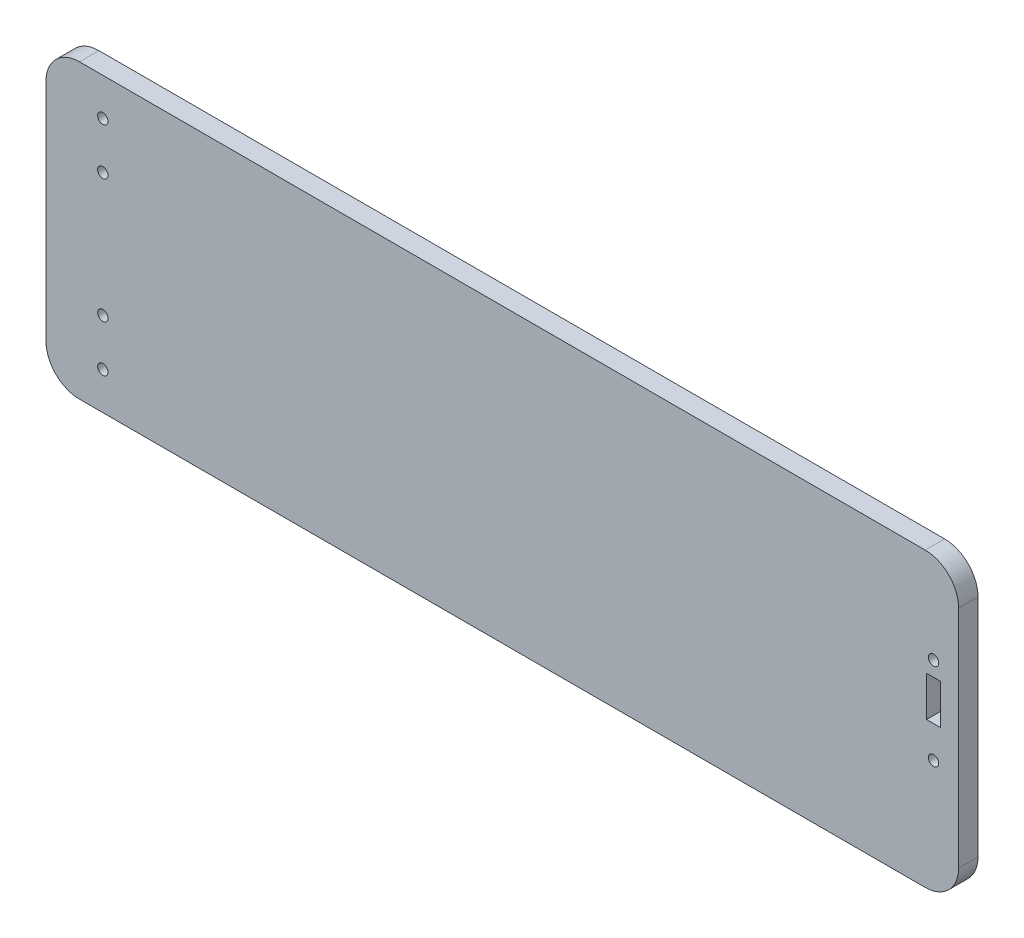
ISO-10303-21;
HEADER;
FILE_DESCRIPTION(('STEP AP214'),'2;1');
FILE_NAME('part.step','',(''),(''),'','','');
FILE_SCHEMA(('AUTOMOTIVE_DESIGN { 1 0 10303 214 1 1 1 1 }'));
ENDSEC;
DATA;
#1=APPLICATION_CONTEXT('core data for automotive mechanical design processes');
#2=APPLICATION_PROTOCOL_DEFINITION('international standard','automotive_design',2000,#1);
#3=PRODUCT_CONTEXT('',#1,'mechanical');
#4=PRODUCT('Part','Part','',(#3));
#5=PRODUCT_RELATED_PRODUCT_CATEGORY('part','',(#4));
#6=PRODUCT_DEFINITION_FORMATION('','',#4);
#7=PRODUCT_DEFINITION_CONTEXT('part definition',#1,'design');
#8=PRODUCT_DEFINITION('design','',#6,#7);
#9=PRODUCT_DEFINITION_SHAPE('','',#8);
#10=(LENGTH_UNIT() NAMED_UNIT(*) SI_UNIT(.MILLI.,.METRE.));
#11=(NAMED_UNIT(*) PLANE_ANGLE_UNIT() SI_UNIT($,.RADIAN.));
#12=(NAMED_UNIT(*) SI_UNIT($,.STERADIAN.) SOLID_ANGLE_UNIT());
#13=UNCERTAINTY_MEASURE_WITH_UNIT(LENGTH_MEASURE(1.E-05),#10,'distance_accuracy_value','');
#14=(GEOMETRIC_REPRESENTATION_CONTEXT(3) GLOBAL_UNCERTAINTY_ASSIGNED_CONTEXT((#13)) GLOBAL_UNIT_ASSIGNED_CONTEXT((#10,
#11,#12)) REPRESENTATION_CONTEXT('',''));
#15=CARTESIAN_POINT('',(0.,0.,0.));
#16=DIRECTION('',(0.,0.,1.));
#17=DIRECTION('',(1.,0.,0.));
#18=AXIS2_PLACEMENT_3D('',#15,#16,#17);
#19=CARTESIAN_POINT('',(263.,33.7,5.8));
#20=DIRECTION('',(0.,0.,-1.));
#21=DIRECTION('',(-1.,0.,0.));
#22=AXIS2_PLACEMENT_3D('',#19,#20,#21);
#23=CYLINDRICAL_SURFACE('',#22,10.);
#24=CARTESIAN_POINT('',(263.,33.7,0.));
#25=DIRECTION('',(0.,0.,1.));
#26=DIRECTION('',(1.,0.,0.));
#27=AXIS2_PLACEMENT_3D('',#24,#25,#26);
#28=CIRCLE('',#27,10.);
#29=CARTESIAN_POINT('',(273.,33.7,0.));
#30=VERTEX_POINT('',#29);
#31=CARTESIAN_POINT('',(263.,43.7,0.));
#32=VERTEX_POINT('',#31);
#33=EDGE_CURVE('E159',#30,#32,#28,.T.);
#34=ORIENTED_EDGE('',*,*,#33,.T.);
#35=DIRECTION('',(0.,0.,-1.));
#36=VECTOR('',#35,1.);
#37=CARTESIAN_POINT('',(263.,43.7,5.8));
#38=LINE('',#37,#36);
#39=CARTESIAN_POINT('',(263.,43.7,5.8));
#40=VERTEX_POINT('',#39);
#41=EDGE_CURVE('E241',#40,#32,#38,.T.);
#42=ORIENTED_EDGE('',*,*,#41,.F.);
#43=CARTESIAN_POINT('',(263.,33.7,5.8));
#44=DIRECTION('',(0.,0.,1.));
#45=DIRECTION('',(1.,0.,0.));
#46=AXIS2_PLACEMENT_3D('',#43,#44,#45);
#47=CIRCLE('',#46,10.);
#48=CARTESIAN_POINT('',(273.,33.7,5.8));
#49=VERTEX_POINT('',#48);
#50=EDGE_CURVE('E164',#49,#40,#47,.T.);
#51=ORIENTED_EDGE('',*,*,#50,.F.);
#52=DIRECTION('',(0.,0.,-1.));
#53=VECTOR('',#52,1.);
#54=CARTESIAN_POINT('',(273.,33.7,5.8));
#55=LINE('',#54,#53);
#56=EDGE_CURVE('E190',#49,#30,#55,.T.);
#57=ORIENTED_EDGE('',*,*,#56,.T.);
#58=EDGE_LOOP('',(#34,#42,#51,#57));
#59=FACE_BOUND('',#58,.T.);
#60=ADVANCED_FACE('F39',(#59),#23,.T.);
#61=CARTESIAN_POINT('',(263.,43.7,5.8));
#62=DIRECTION('',(0.,-1.,0.));
#63=DIRECTION('',(1.,0.,0.));
#64=AXIS2_PLACEMENT_3D('',#61,#62,#63);
#65=PLANE('',#64);
#66=DIRECTION('',(-1.,0.,0.));
#67=VECTOR('',#66,1.);
#68=CARTESIAN_POINT('',(263.,43.7,0.));
#69=LINE('',#68,#67);
#70=CARTESIAN_POINT('',(10.,43.7,0.));
#71=VERTEX_POINT('',#70);
#72=EDGE_CURVE('E194',#32,#71,#69,.T.);
#73=ORIENTED_EDGE('',*,*,#72,.T.);
#74=DIRECTION('',(0.,0.,-1.));
#75=VECTOR('',#74,1.);
#76=CARTESIAN_POINT('',(10.,43.7,5.8));
#77=LINE('',#76,#75);
#78=CARTESIAN_POINT('',(10.,43.7,5.8));
#79=VERTEX_POINT('',#78);
#80=EDGE_CURVE('E237',#79,#71,#77,.T.);
#81=ORIENTED_EDGE('',*,*,#80,.F.);
#82=DIRECTION('',(-1.,0.,0.));
#83=VECTOR('',#82,1.);
#84=CARTESIAN_POINT('',(263.,43.7,5.8));
#85=LINE('',#84,#83);
#86=EDGE_CURVE('E168',#40,#79,#85,.T.);
#87=ORIENTED_EDGE('',*,*,#86,.F.);
#88=ORIENTED_EDGE('',*,*,#41,.T.);
#89=EDGE_LOOP('',(#73,#81,#87,#88));
#90=FACE_BOUND('',#89,.T.);
#91=ADVANCED_FACE('F270',(#90),#65,.F.);
#92=CARTESIAN_POINT('',(10.,33.7,5.8));
#93=DIRECTION('',(0.,0.,-1.));
#94=DIRECTION('',(-1.,0.,0.));
#95=AXIS2_PLACEMENT_3D('',#92,#93,#94);
#96=CYLINDRICAL_SURFACE('',#95,10.);
#97=CARTESIAN_POINT('',(10.,33.7,0.));
#98=DIRECTION('',(0.,0.,1.));
#99=DIRECTION('',(1.,0.,0.));
#100=AXIS2_PLACEMENT_3D('',#97,#98,#99);
#101=CIRCLE('',#100,10.);
#102=CARTESIAN_POINT('',(0.,33.7,0.));
#103=VERTEX_POINT('',#102);
#104=EDGE_CURVE('E197',#71,#103,#101,.T.);
#105=ORIENTED_EDGE('',*,*,#104,.T.);
#106=DIRECTION('',(0.,0.,-1.));
#107=VECTOR('',#106,1.);
#108=CARTESIAN_POINT('',(0.,33.7,5.8));
#109=LINE('',#108,#107);
#110=CARTESIAN_POINT('',(0.,33.7,5.8));
#111=VERTEX_POINT('',#110);
#112=EDGE_CURVE('E233',#111,#103,#109,.T.);
#113=ORIENTED_EDGE('',*,*,#112,.F.);
#114=CARTESIAN_POINT('',(10.,33.7,5.8));
#115=DIRECTION('',(0.,0.,1.));
#116=DIRECTION('',(1.,0.,0.));
#117=AXIS2_PLACEMENT_3D('',#114,#115,#116);
#118=CIRCLE('',#117,10.);
#119=EDGE_CURVE('E172',#79,#111,#118,.T.);
#120=ORIENTED_EDGE('',*,*,#119,.F.);
#121=ORIENTED_EDGE('',*,*,#80,.T.);
#122=EDGE_LOOP('',(#105,#113,#120,#121));
#123=FACE_BOUND('',#122,.T.);
#124=ADVANCED_FACE('F275',(#123),#96,.T.);
#125=CARTESIAN_POINT('',(0.,33.7,5.8));
#126=DIRECTION('',(1.,0.,0.));
#127=DIRECTION('',(0.,0.,-1.));
#128=AXIS2_PLACEMENT_3D('',#125,#126,#127);
#129=PLANE('',#128);
#130=DIRECTION('',(0.,-1.,0.));
#131=VECTOR('',#130,1.);
#132=CARTESIAN_POINT('',(0.,33.7,0.));
#133=LINE('',#132,#131);
#134=CARTESIAN_POINT('',(0.,-33.7,0.));
#135=VERTEX_POINT('',#134);
#136=EDGE_CURVE('E200',#103,#135,#133,.T.);
#137=ORIENTED_EDGE('',*,*,#136,.T.);
#138=DIRECTION('',(0.,0.,-1.));
#139=VECTOR('',#138,1.);
#140=CARTESIAN_POINT('',(0.,-33.7,5.8));
#141=LINE('',#140,#139);
#142=CARTESIAN_POINT('',(0.,-33.7,5.8));
#143=VERTEX_POINT('',#142);
#144=EDGE_CURVE('E229',#143,#135,#141,.T.);
#145=ORIENTED_EDGE('',*,*,#144,.F.);
#146=DIRECTION('',(0.,-1.,0.));
#147=VECTOR('',#146,1.);
#148=CARTESIAN_POINT('',(0.,33.7,5.8));
#149=LINE('',#148,#147);
#150=EDGE_CURVE('E175',#111,#143,#149,.T.);
#151=ORIENTED_EDGE('',*,*,#150,.F.);
#152=ORIENTED_EDGE('',*,*,#112,.T.);
#153=EDGE_LOOP('',(#137,#145,#151,#152));
#154=FACE_BOUND('',#153,.T.);
#155=ADVANCED_FACE('F307',(#154),#129,.F.);
#156=CARTESIAN_POINT('',(10.,-33.7,5.8));
#157=DIRECTION('',(0.,0.,-1.));
#158=DIRECTION('',(-1.,0.,0.));
#159=AXIS2_PLACEMENT_3D('',#156,#157,#158);
#160=CYLINDRICAL_SURFACE('',#159,10.);
#161=CARTESIAN_POINT('',(10.,-33.7,0.));
#162=DIRECTION('',(0.,0.,1.));
#163=DIRECTION('',(1.,0.,0.));
#164=AXIS2_PLACEMENT_3D('',#161,#162,#163);
#165=CIRCLE('',#164,10.);
#166=CARTESIAN_POINT('',(10.,-43.7,0.));
#167=VERTEX_POINT('',#166);
#168=EDGE_CURVE('E203',#135,#167,#165,.T.);
#169=ORIENTED_EDGE('',*,*,#168,.T.);
#170=DIRECTION('',(0.,0.,-1.));
#171=VECTOR('',#170,1.);
#172=CARTESIAN_POINT('',(10.,-43.7,5.8));
#173=LINE('',#172,#171);
#174=CARTESIAN_POINT('',(10.,-43.7,5.8));
#175=VERTEX_POINT('',#174);
#176=EDGE_CURVE('E225',#175,#167,#173,.T.);
#177=ORIENTED_EDGE('',*,*,#176,.F.);
#178=CARTESIAN_POINT('',(10.,-33.7,5.8));
#179=DIRECTION('',(0.,0.,1.));
#180=DIRECTION('',(1.,0.,0.));
#181=AXIS2_PLACEMENT_3D('',#178,#179,#180);
#182=CIRCLE('',#181,10.);
#183=EDGE_CURVE('E178',#143,#175,#182,.T.);
#184=ORIENTED_EDGE('',*,*,#183,.F.);
#185=ORIENTED_EDGE('',*,*,#144,.T.);
#186=EDGE_LOOP('',(#169,#177,#184,#185));
#187=FACE_BOUND('',#186,.T.);
#188=ADVANCED_FACE('F303',(#187),#160,.T.);
#189=CARTESIAN_POINT('',(263.,-43.7,5.8));
#190=DIRECTION('',(0.,1.,0.));
#191=DIRECTION('',(-1.,0.,0.));
#192=AXIS2_PLACEMENT_3D('',#189,#190,#191);
#193=PLANE('',#192);
#194=DIRECTION('',(1.,0.,0.));
#195=VECTOR('',#194,1.);
#196=CARTESIAN_POINT('',(263.,-43.7,0.));
#197=LINE('',#196,#195);
#198=CARTESIAN_POINT('',(263.,-43.7,0.));
#199=VERTEX_POINT('',#198);
#200=EDGE_CURVE('E206',#167,#199,#197,.T.);
#201=ORIENTED_EDGE('',*,*,#200,.T.);
#202=DIRECTION('',(0.,0.,-1.));
#203=VECTOR('',#202,1.);
#204=CARTESIAN_POINT('',(263.,-43.7,5.8));
#205=LINE('',#204,#203);
#206=CARTESIAN_POINT('',(263.,-43.7,5.8));
#207=VERTEX_POINT('',#206);
#208=EDGE_CURVE('E221',#207,#199,#205,.T.);
#209=ORIENTED_EDGE('',*,*,#208,.F.);
#210=DIRECTION('',(1.,0.,0.));
#211=VECTOR('',#210,1.);
#212=CARTESIAN_POINT('',(263.,-43.7,5.8));
#213=LINE('',#212,#211);
#214=EDGE_CURVE('E181',#175,#207,#213,.T.);
#215=ORIENTED_EDGE('',*,*,#214,.F.);
#216=ORIENTED_EDGE('',*,*,#176,.T.);
#217=EDGE_LOOP('',(#201,#209,#215,#216));
#218=FACE_BOUND('',#217,.T.);
#219=ADVANCED_FACE('F298',(#218),#193,.F.);
#220=CARTESIAN_POINT('',(263.,-33.7,5.8));
#221=DIRECTION('',(0.,0.,-1.));
#222=DIRECTION('',(-1.,0.,0.));
#223=AXIS2_PLACEMENT_3D('',#220,#221,#222);
#224=CYLINDRICAL_SURFACE('',#223,10.);
#225=CARTESIAN_POINT('',(263.,-33.7,0.));
#226=DIRECTION('',(0.,0.,1.));
#227=DIRECTION('',(1.,0.,0.));
#228=AXIS2_PLACEMENT_3D('',#225,#226,#227);
#229=CIRCLE('',#228,10.);
#230=CARTESIAN_POINT('',(273.,-33.7,0.));
#231=VERTEX_POINT('',#230);
#232=EDGE_CURVE('E209',#199,#231,#229,.T.);
#233=ORIENTED_EDGE('',*,*,#232,.T.);
#234=DIRECTION('',(0.,0.,-1.));
#235=VECTOR('',#234,1.);
#236=CARTESIAN_POINT('',(273.,-33.7,5.8));
#237=LINE('',#236,#235);
#238=CARTESIAN_POINT('',(273.,-33.7,5.8));
#239=VERTEX_POINT('',#238);
#240=EDGE_CURVE('E217',#239,#231,#237,.T.);
#241=ORIENTED_EDGE('',*,*,#240,.F.);
#242=CARTESIAN_POINT('',(263.,-33.7,5.8));
#243=DIRECTION('',(0.,0.,1.));
#244=DIRECTION('',(1.,0.,0.));
#245=AXIS2_PLACEMENT_3D('',#242,#243,#244);
#246=CIRCLE('',#245,10.);
#247=EDGE_CURVE('E184',#207,#239,#246,.T.);
#248=ORIENTED_EDGE('',*,*,#247,.F.);
#249=ORIENTED_EDGE('',*,*,#208,.T.);
#250=EDGE_LOOP('',(#233,#241,#248,#249));
#251=FACE_BOUND('',#250,.T.);
#252=ADVANCED_FACE('F293',(#251),#224,.T.);
#253=CARTESIAN_POINT('',(273.,33.7,5.8));
#254=DIRECTION('',(-1.,0.,0.));
#255=DIRECTION('',(0.,0.,1.));
#256=AXIS2_PLACEMENT_3D('',#253,#254,#255);
#257=PLANE('',#256);
#258=DIRECTION('',(0.,1.,0.));
#259=VECTOR('',#258,1.);
#260=CARTESIAN_POINT('',(273.,33.7,0.));
#261=LINE('',#260,#259);
#262=EDGE_CURVE('E169',#231,#30,#261,.T.);
#263=ORIENTED_EDGE('',*,*,#262,.T.);
#264=ORIENTED_EDGE('',*,*,#56,.F.);
#265=DIRECTION('',(0.,1.,0.));
#266=VECTOR('',#265,1.);
#267=CARTESIAN_POINT('',(273.,33.7,5.8));
#268=LINE('',#267,#266);
#269=EDGE_CURVE('E187',#239,#49,#268,.T.);
#270=ORIENTED_EDGE('',*,*,#269,.F.);
#271=ORIENTED_EDGE('',*,*,#240,.T.);
#272=EDGE_LOOP('',(#263,#264,#270,#271));
#273=FACE_BOUND('',#272,.T.);
#274=ADVANCED_FACE('F291',(#273),#257,.F.);
#275=CARTESIAN_POINT('',(263.,33.7,5.8));
#276=DIRECTION('',(0.,0.,1.));
#277=DIRECTION('',(1.,0.,0.));
#278=AXIS2_PLACEMENT_3D('',#275,#276,#277);
#279=PLANE('',#278);
#280=CARTESIAN_POINT('',(265.5,16.45,5.8));
#281=DIRECTION('',(0.,0.,1.));
#282=DIRECTION('',(1.,0.,0.));
#283=AXIS2_PLACEMENT_3D('',#280,#281,#282);
#284=CIRCLE('',#283,1.54999999999999);
#285=CARTESIAN_POINT('',(267.05,16.45,5.8));
#286=VERTEX_POINT('',#285);
#287=EDGE_CURVE('E331',#286,#286,#284,.T.);
#288=ORIENTED_EDGE('',*,*,#287,.F.);
#289=EDGE_LOOP('',(#288));
#290=FACE_BOUND('',#289,.T.);
#291=CARTESIAN_POINT('',(265.5,-9.55,5.8));
#292=DIRECTION('',(0.,0.,1.));
#293=DIRECTION('',(1.,0.,0.));
#294=AXIS2_PLACEMENT_3D('',#291,#292,#293);
#295=CIRCLE('',#294,1.54999999999999);
#296=CARTESIAN_POINT('',(267.05,-9.55,5.8));
#297=VERTEX_POINT('',#296);
#298=EDGE_CURVE('E335',#297,#297,#295,.T.);
#299=ORIENTED_EDGE('',*,*,#298,.F.);
#300=EDGE_LOOP('',(#299));
#301=FACE_BOUND('',#300,.T.);
#302=CARTESIAN_POINT('',(17.,32.5,5.8));
#303=DIRECTION('',(0.,0.,1.));
#304=DIRECTION('',(1.,0.,0.));
#305=AXIS2_PLACEMENT_3D('',#302,#303,#304);
#306=CIRCLE('',#305,1.54999999999999);
#307=CARTESIAN_POINT('',(18.55,32.5,5.8));
#308=VERTEX_POINT('',#307);
#309=EDGE_CURVE('E339',#308,#308,#306,.T.);
#310=ORIENTED_EDGE('',*,*,#309,.F.);
#311=EDGE_LOOP('',(#310));
#312=FACE_BOUND('',#311,.T.);
#313=CARTESIAN_POINT('',(17.,18.5,5.8));
#314=DIRECTION('',(0.,0.,1.));
#315=DIRECTION('',(1.,0.,0.));
#316=AXIS2_PLACEMENT_3D('',#313,#314,#315);
#317=CIRCLE('',#316,1.55);
#318=CARTESIAN_POINT('',(18.55,18.5,5.8));
#319=VERTEX_POINT('',#318);
#320=EDGE_CURVE('E343',#319,#319,#317,.T.);
#321=ORIENTED_EDGE('',*,*,#320,.F.);
#322=EDGE_LOOP('',(#321));
#323=FACE_BOUND('',#322,.T.);
#324=CARTESIAN_POINT('',(17.,-18.5,5.8));
#325=DIRECTION('',(0.,0.,1.));
#326=DIRECTION('',(-1.,0.,0.));
#327=AXIS2_PLACEMENT_3D('',#324,#325,#326);
#328=CIRCLE('',#327,1.55);
#329=CARTESIAN_POINT('',(15.45,-18.5,5.8));
#330=VERTEX_POINT('',#329);
#331=EDGE_CURVE('E347',#330,#330,#328,.T.);
#332=ORIENTED_EDGE('',*,*,#331,.F.);
#333=EDGE_LOOP('',(#332));
#334=FACE_BOUND('',#333,.T.);
#335=CARTESIAN_POINT('',(17.,-32.5,5.8));
#336=DIRECTION('',(0.,0.,1.));
#337=DIRECTION('',(-1.,0.,0.));
#338=AXIS2_PLACEMENT_3D('',#335,#336,#337);
#339=CIRCLE('',#338,1.54999999999999);
#340=CARTESIAN_POINT('',(15.45,-32.5,5.8));
#341=VERTEX_POINT('',#340);
#342=EDGE_CURVE('E350',#341,#341,#339,.T.);
#343=ORIENTED_EDGE('',*,*,#342,.F.);
#344=EDGE_LOOP('',(#343));
#345=FACE_BOUND('',#344,.T.);
#346=DIRECTION('',(0.,1.,0.));
#347=VECTOR('',#346,1.);
#348=CARTESIAN_POINT('',(267.6,0.,5.8));
#349=LINE('',#348,#347);
#350=CARTESIAN_POINT('',(267.6,0.,5.8));
#351=VERTEX_POINT('',#350);
#352=CARTESIAN_POINT('',(267.6,12.,5.8));
#353=VERTEX_POINT('',#352);
#354=EDGE_CURVE('E54',#351,#353,#349,.T.);
#355=ORIENTED_EDGE('',*,*,#354,.F.);
#356=DIRECTION('',(1.,0.,0.));
#357=VECTOR('',#356,1.);
#358=CARTESIAN_POINT('',(267.6,0.,5.8));
#359=LINE('',#358,#357);
#360=CARTESIAN_POINT('',(263.4,0.,5.8));
#361=VERTEX_POINT('',#360);
#362=EDGE_CURVE('E149',#361,#351,#359,.T.);
#363=ORIENTED_EDGE('',*,*,#362,.F.);
#364=DIRECTION('',(0.,-1.,0.));
#365=VECTOR('',#364,1.);
#366=CARTESIAN_POINT('',(263.4,0.,5.8));
#367=LINE('',#366,#365);
#368=CARTESIAN_POINT('',(263.4,12.,5.8));
#369=VERTEX_POINT('',#368);
#370=EDGE_CURVE('E131',#369,#361,#367,.T.);
#371=ORIENTED_EDGE('',*,*,#370,.F.);
#372=DIRECTION('',(-1.,0.,0.));
#373=VECTOR('',#372,1.);
#374=CARTESIAN_POINT('',(267.6,12.,5.8));
#375=LINE('',#374,#373);
#376=EDGE_CURVE('E141',#353,#369,#375,.T.);
#377=ORIENTED_EDGE('',*,*,#376,.F.);
#378=EDGE_LOOP('',(#355,#363,#371,#377));
#379=FACE_BOUND('',#378,.T.);
#380=ORIENTED_EDGE('',*,*,#50,.T.);
#381=ORIENTED_EDGE('',*,*,#86,.T.);
#382=ORIENTED_EDGE('',*,*,#119,.T.);
#383=ORIENTED_EDGE('',*,*,#150,.T.);
#384=ORIENTED_EDGE('',*,*,#183,.T.);
#385=ORIENTED_EDGE('',*,*,#214,.T.);
#386=ORIENTED_EDGE('',*,*,#247,.T.);
#387=ORIENTED_EDGE('',*,*,#269,.T.);
#388=EDGE_LOOP('',(#380,#381,#382,#383,#384,#385,#386,#387));
#389=FACE_BOUND('',#388,.T.);
#390=ADVANCED_FACE('F146',(#290,#301,#312,#323,#334,#345,#379,#389),#279,.T.);
#391=CARTESIAN_POINT('',(263.,33.7,0.));
#392=DIRECTION('',(0.,0.,1.));
#393=DIRECTION('',(1.,0.,0.));
#394=AXIS2_PLACEMENT_3D('',#391,#392,#393);
#395=PLANE('',#394);
#396=CARTESIAN_POINT('',(265.5,16.45,0.));
#397=DIRECTION('',(0.,0.,1.));
#398=DIRECTION('',(1.,0.,0.));
#399=AXIS2_PLACEMENT_3D('',#396,#397,#398);
#400=CIRCLE('',#399,1.54999999999999);
#401=CARTESIAN_POINT('',(267.05,16.45,0.));
#402=VERTEX_POINT('',#401);
#403=EDGE_CURVE('E354',#402,#402,#400,.T.);
#404=ORIENTED_EDGE('',*,*,#403,.T.);
#405=EDGE_LOOP('',(#404));
#406=FACE_BOUND('',#405,.T.);
#407=CARTESIAN_POINT('',(265.5,-9.55,0.));
#408=DIRECTION('',(0.,0.,1.));
#409=DIRECTION('',(1.,0.,0.));
#410=AXIS2_PLACEMENT_3D('',#407,#408,#409);
#411=CIRCLE('',#410,1.54999999999999);
#412=CARTESIAN_POINT('',(267.05,-9.55,0.));
#413=VERTEX_POINT('',#412);
#414=EDGE_CURVE('E471',#413,#413,#411,.T.);
#415=ORIENTED_EDGE('',*,*,#414,.T.);
#416=EDGE_LOOP('',(#415));
#417=FACE_BOUND('',#416,.T.);
#418=CARTESIAN_POINT('',(17.,32.5,0.));
#419=DIRECTION('',(0.,0.,1.));
#420=DIRECTION('',(1.,0.,0.));
#421=AXIS2_PLACEMENT_3D('',#418,#419,#420);
#422=CIRCLE('',#421,1.54999999999999);
#423=CARTESIAN_POINT('',(18.55,32.5,0.));
#424=VERTEX_POINT('',#423);
#425=EDGE_CURVE('E364',#424,#424,#422,.T.);
#426=ORIENTED_EDGE('',*,*,#425,.T.);
#427=EDGE_LOOP('',(#426));
#428=FACE_BOUND('',#427,.T.);
#429=CARTESIAN_POINT('',(17.,18.5,0.));
#430=DIRECTION('',(0.,0.,1.));
#431=DIRECTION('',(1.,0.,0.));
#432=AXIS2_PLACEMENT_3D('',#429,#430,#431);
#433=CIRCLE('',#432,1.55);
#434=CARTESIAN_POINT('',(18.55,18.5,0.));
#435=VERTEX_POINT('',#434);
#436=EDGE_CURVE('E371',#435,#435,#433,.T.);
#437=ORIENTED_EDGE('',*,*,#436,.T.);
#438=EDGE_LOOP('',(#437));
#439=FACE_BOUND('',#438,.T.);
#440=CARTESIAN_POINT('',(17.,-18.5,0.));
#441=DIRECTION('',(0.,0.,1.));
#442=DIRECTION('',(-1.,0.,0.));
#443=AXIS2_PLACEMENT_3D('',#440,#441,#442);
#444=CIRCLE('',#443,1.55);
#445=CARTESIAN_POINT('',(15.45,-18.5,0.));
#446=VERTEX_POINT('',#445);
#447=EDGE_CURVE('E381',#446,#446,#444,.T.);
#448=ORIENTED_EDGE('',*,*,#447,.T.);
#449=EDGE_LOOP('',(#448));
#450=FACE_BOUND('',#449,.T.);
#451=CARTESIAN_POINT('',(17.,-32.5,0.));
#452=DIRECTION('',(0.,0.,1.));
#453=DIRECTION('',(-1.,0.,0.));
#454=AXIS2_PLACEMENT_3D('',#451,#452,#453);
#455=CIRCLE('',#454,1.54999999999999);
#456=CARTESIAN_POINT('',(15.45,-32.5,0.));
#457=VERTEX_POINT('',#456);
#458=EDGE_CURVE('E353',#457,#457,#455,.T.);
#459=ORIENTED_EDGE('',*,*,#458,.T.);
#460=EDGE_LOOP('',(#459));
#461=FACE_BOUND('',#460,.T.);
#462=DIRECTION('',(1.,0.,0.));
#463=VECTOR('',#462,1.);
#464=CARTESIAN_POINT('',(263.,0.,0.));
#465=LINE('',#464,#463);
#466=CARTESIAN_POINT('',(263.4,0.,0.));
#467=VERTEX_POINT('',#466);
#468=CARTESIAN_POINT('',(267.6,0.,0.));
#469=VERTEX_POINT('',#468);
#470=EDGE_CURVE('E47',#467,#469,#465,.T.);
#471=ORIENTED_EDGE('',*,*,#470,.T.);
#472=DIRECTION('',(0.,1.,0.));
#473=VECTOR('',#472,1.);
#474=CARTESIAN_POINT('',(267.6,33.7,0.));
#475=LINE('',#474,#473);
#476=CARTESIAN_POINT('',(267.6,12.,0.));
#477=VERTEX_POINT('',#476);
#478=EDGE_CURVE('E11',#469,#477,#475,.T.);
#479=ORIENTED_EDGE('',*,*,#478,.T.);
#480=DIRECTION('',(-1.,0.,0.));
#481=VECTOR('',#480,1.);
#482=CARTESIAN_POINT('',(263.,12.,0.));
#483=LINE('',#482,#481);
#484=CARTESIAN_POINT('',(263.4,12.,0.));
#485=VERTEX_POINT('',#484);
#486=EDGE_CURVE('E245',#477,#485,#483,.T.);
#487=ORIENTED_EDGE('',*,*,#486,.T.);
#488=DIRECTION('',(0.,-1.,0.));
#489=VECTOR('',#488,1.);
#490=CARTESIAN_POINT('',(263.4,33.7,0.));
#491=LINE('',#490,#489);
#492=EDGE_CURVE('E134',#485,#467,#491,.T.);
#493=ORIENTED_EDGE('',*,*,#492,.T.);
#494=EDGE_LOOP('',(#471,#479,#487,#493));
#495=FACE_BOUND('',#494,.T.);
#496=ORIENTED_EDGE('',*,*,#33,.F.);
#497=ORIENTED_EDGE('',*,*,#262,.F.);
#498=ORIENTED_EDGE('',*,*,#232,.F.);
#499=ORIENTED_EDGE('',*,*,#200,.F.);
#500=ORIENTED_EDGE('',*,*,#168,.F.);
#501=ORIENTED_EDGE('',*,*,#136,.F.);
#502=ORIENTED_EDGE('',*,*,#104,.F.);
#503=ORIENTED_EDGE('',*,*,#72,.F.);
#504=EDGE_LOOP('',(#496,#497,#498,#499,#500,#501,#502,#503));
#505=FACE_BOUND('',#504,.T.);
#506=ADVANCED_FACE('F252',(#406,#417,#428,#439,#450,#461,#495,#505),#395,.F.);
#507=CARTESIAN_POINT('',(267.6,0.,-0.55));
#508=DIRECTION('',(1.,0.,0.));
#509=DIRECTION('',(0.,0.,-1.));
#510=AXIS2_PLACEMENT_3D('',#507,#508,#509);
#511=PLANE('',#510);
#512=DIRECTION('',(0.,0.,1.));
#513=VECTOR('',#512,1.);
#514=CARTESIAN_POINT('',(267.6,0.,-0.55));
#515=LINE('',#514,#513);
#516=EDGE_CURVE('E156',#469,#351,#515,.T.);
#517=ORIENTED_EDGE('',*,*,#516,.T.);
#518=ORIENTED_EDGE('',*,*,#354,.T.);
#519=DIRECTION('',(0.,0.,1.));
#520=VECTOR('',#519,1.);
#521=CARTESIAN_POINT('',(267.6,12.,-0.55));
#522=LINE('',#521,#520);
#523=EDGE_CURVE('E138',#477,#353,#522,.T.);
#524=ORIENTED_EDGE('',*,*,#523,.F.);
#525=ORIENTED_EDGE('',*,*,#478,.F.);
#526=EDGE_LOOP('',(#517,#518,#524,#525));
#527=FACE_BOUND('',#526,.T.);
#528=ADVANCED_FACE('F257',(#527),#511,.F.);
#529=CARTESIAN_POINT('',(267.6,0.,-0.55));
#530=DIRECTION('',(0.,-1.,0.));
#531=DIRECTION('',(1.,0.,0.));
#532=AXIS2_PLACEMENT_3D('',#529,#530,#531);
#533=PLANE('',#532);
#534=DIRECTION('',(0.,0.,1.));
#535=VECTOR('',#534,1.);
#536=CARTESIAN_POINT('',(263.4,0.,-0.55));
#537=LINE('',#536,#535);
#538=EDGE_CURVE('E137',#467,#361,#537,.T.);
#539=ORIENTED_EDGE('',*,*,#538,.T.);
#540=ORIENTED_EDGE('',*,*,#362,.T.);
#541=ORIENTED_EDGE('',*,*,#516,.F.);
#542=ORIENTED_EDGE('',*,*,#470,.F.);
#543=EDGE_LOOP('',(#539,#540,#541,#542));
#544=FACE_BOUND('',#543,.T.);
#545=ADVANCED_FACE('F256',(#544),#533,.F.);
#546=CARTESIAN_POINT('',(263.4,0.,-0.55));
#547=DIRECTION('',(-1.,0.,0.));
#548=DIRECTION('',(0.,0.,1.));
#549=AXIS2_PLACEMENT_3D('',#546,#547,#548);
#550=PLANE('',#549);
#551=DIRECTION('',(0.,0.,1.));
#552=VECTOR('',#551,1.);
#553=CARTESIAN_POINT('',(263.4,12.,-0.55));
#554=LINE('',#553,#552);
#555=EDGE_CURVE('E62',#485,#369,#554,.T.);
#556=ORIENTED_EDGE('',*,*,#555,.T.);
#557=ORIENTED_EDGE('',*,*,#370,.T.);
#558=ORIENTED_EDGE('',*,*,#538,.F.);
#559=ORIENTED_EDGE('',*,*,#492,.F.);
#560=EDGE_LOOP('',(#556,#557,#558,#559));
#561=FACE_BOUND('',#560,.T.);
#562=ADVANCED_FACE('F128',(#561),#550,.F.);
#563=CARTESIAN_POINT('',(267.6,12.,-0.55));
#564=DIRECTION('',(0.,1.,0.));
#565=DIRECTION('',(-1.,0.,0.));
#566=AXIS2_PLACEMENT_3D('',#563,#564,#565);
#567=PLANE('',#566);
#568=ORIENTED_EDGE('',*,*,#523,.T.);
#569=ORIENTED_EDGE('',*,*,#376,.T.);
#570=ORIENTED_EDGE('',*,*,#555,.F.);
#571=ORIENTED_EDGE('',*,*,#486,.F.);
#572=EDGE_LOOP('',(#568,#569,#570,#571));
#573=FACE_BOUND('',#572,.T.);
#574=ADVANCED_FACE('F142',(#573),#567,.F.);
#575=CARTESIAN_POINT('',(17.,-32.5,0.));
#576=DIRECTION('',(0.,0.,1.));
#577=DIRECTION('',(1.,0.,0.));
#578=AXIS2_PLACEMENT_3D('',#575,#576,#577);
#579=CYLINDRICAL_SURFACE('',#578,1.54999999999999);
#580=ORIENTED_EDGE('',*,*,#458,.F.);
#581=EDGE_LOOP('',(#580));
#582=FACE_BOUND('',#581,.T.);
#583=ORIENTED_EDGE('',*,*,#342,.T.);
#584=EDGE_LOOP('',(#583));
#585=FACE_BOUND('',#584,.T.);
#586=ADVANCED_FACE('F389',(#582,#585),#579,.F.);
#587=CARTESIAN_POINT('',(17.,-18.5,0.));
#588=DIRECTION('',(0.,0.,1.));
#589=DIRECTION('',(1.,0.,0.));
#590=AXIS2_PLACEMENT_3D('',#587,#588,#589);
#591=CYLINDRICAL_SURFACE('',#590,1.55);
#592=ORIENTED_EDGE('',*,*,#447,.F.);
#593=EDGE_LOOP('',(#592));
#594=FACE_BOUND('',#593,.T.);
#595=ORIENTED_EDGE('',*,*,#331,.T.);
#596=EDGE_LOOP('',(#595));
#597=FACE_BOUND('',#596,.T.);
#598=ADVANCED_FACE('F386',(#594,#597),#591,.F.);
#599=CARTESIAN_POINT('',(17.,18.5,0.));
#600=DIRECTION('',(0.,0.,1.));
#601=DIRECTION('',(1.,0.,0.));
#602=AXIS2_PLACEMENT_3D('',#599,#600,#601);
#603=CYLINDRICAL_SURFACE('',#602,1.55);
#604=ORIENTED_EDGE('',*,*,#436,.F.);
#605=EDGE_LOOP('',(#604));
#606=FACE_BOUND('',#605,.T.);
#607=ORIENTED_EDGE('',*,*,#320,.T.);
#608=EDGE_LOOP('',(#607));
#609=FACE_BOUND('',#608,.T.);
#610=ADVANCED_FACE('F388',(#606,#609),#603,.F.);
#611=CARTESIAN_POINT('',(17.,32.5,0.));
#612=DIRECTION('',(0.,0.,1.));
#613=DIRECTION('',(1.,0.,0.));
#614=AXIS2_PLACEMENT_3D('',#611,#612,#613);
#615=CYLINDRICAL_SURFACE('',#614,1.54999999999999);
#616=ORIENTED_EDGE('',*,*,#425,.F.);
#617=EDGE_LOOP('',(#616));
#618=FACE_BOUND('',#617,.T.);
#619=ORIENTED_EDGE('',*,*,#309,.T.);
#620=EDGE_LOOP('',(#619));
#621=FACE_BOUND('',#620,.T.);
#622=ADVANCED_FACE('F396',(#618,#621),#615,.F.);
#623=CARTESIAN_POINT('',(265.5,-9.55,0.));
#624=DIRECTION('',(0.,0.,1.));
#625=DIRECTION('',(1.,0.,0.));
#626=AXIS2_PLACEMENT_3D('',#623,#624,#625);
#627=CYLINDRICAL_SURFACE('',#626,1.54999999999999);
#628=ORIENTED_EDGE('',*,*,#414,.F.);
#629=EDGE_LOOP('',(#628));
#630=FACE_BOUND('',#629,.T.);
#631=ORIENTED_EDGE('',*,*,#298,.T.);
#632=EDGE_LOOP('',(#631));
#633=FACE_BOUND('',#632,.T.);
#634=ADVANCED_FACE('F432',(#630,#633),#627,.F.);
#635=CARTESIAN_POINT('',(265.5,16.45,0.));
#636=DIRECTION('',(0.,0.,1.));
#637=DIRECTION('',(1.,0.,0.));
#638=AXIS2_PLACEMENT_3D('',#635,#636,#637);
#639=CYLINDRICAL_SURFACE('',#638,1.54999999999999);
#640=ORIENTED_EDGE('',*,*,#403,.F.);
#641=EDGE_LOOP('',(#640));
#642=FACE_BOUND('',#641,.T.);
#643=ORIENTED_EDGE('',*,*,#287,.T.);
#644=EDGE_LOOP('',(#643));
#645=FACE_BOUND('',#644,.T.);
#646=ADVANCED_FACE('F454',(#642,#645),#639,.F.);
#647=CLOSED_SHELL('',(#60,#91,#124,#155,#188,#219,#252,#274,#390,#506,#528,#545,#562,#574,#586,
#598,#610,#622,#634,#646));
#648=MANIFOLD_SOLID_BREP('B2',#647);
#649=ADVANCED_BREP_SHAPE_REPRESENTATION('',(#18,#648),#14);
#650=SHAPE_DEFINITION_REPRESENTATION(#9,#649);
ENDSEC;
END-ISO-10303-21;
